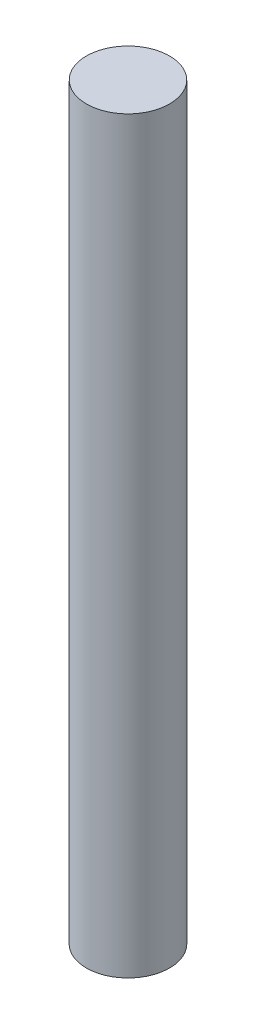
ISO-10303-21;
HEADER;
FILE_DESCRIPTION(('STEP AP214'),'2;1');
FILE_NAME('part.step','',(''),(''),'','','');
FILE_SCHEMA(('AUTOMOTIVE_DESIGN { 1 0 10303 214 1 1 1 1 }'));
ENDSEC;
DATA;
#1=APPLICATION_CONTEXT('core data for automotive mechanical design processes');
#2=APPLICATION_PROTOCOL_DEFINITION('international standard','automotive_design',2000,#1);
#3=PRODUCT_CONTEXT('',#1,'mechanical');
#4=PRODUCT('Part','Part','',(#3));
#5=PRODUCT_RELATED_PRODUCT_CATEGORY('part','',(#4));
#6=PRODUCT_DEFINITION_FORMATION('','',#4);
#7=PRODUCT_DEFINITION_CONTEXT('part definition',#1,'design');
#8=PRODUCT_DEFINITION('design','',#6,#7);
#9=PRODUCT_DEFINITION_SHAPE('','',#8);
#10=(LENGTH_UNIT() NAMED_UNIT(*) SI_UNIT(.MILLI.,.METRE.));
#11=(NAMED_UNIT(*) PLANE_ANGLE_UNIT() SI_UNIT($,.RADIAN.));
#12=(NAMED_UNIT(*) SI_UNIT($,.STERADIAN.) SOLID_ANGLE_UNIT());
#13=UNCERTAINTY_MEASURE_WITH_UNIT(LENGTH_MEASURE(1.E-05),#10,'distance_accuracy_value','');
#14=(GEOMETRIC_REPRESENTATION_CONTEXT(3) GLOBAL_UNCERTAINTY_ASSIGNED_CONTEXT((#13)) GLOBAL_UNIT_ASSIGNED_CONTEXT((#10,
#11,#12)) REPRESENTATION_CONTEXT('',''));
#15=CARTESIAN_POINT('',(0.,0.,0.));
#16=DIRECTION('',(0.,0.,1.));
#17=DIRECTION('',(1.,0.,0.));
#18=AXIS2_PLACEMENT_3D('',#15,#16,#17);
#19=CARTESIAN_POINT('',(0.,18.,0.));
#20=DIRECTION('',(0.,-1.,0.));
#21=DIRECTION('',(0.,0.,-1.));
#22=AXIS2_PLACEMENT_3D('',#19,#20,#21);
#23=CYLINDRICAL_SURFACE('',#22,2.);
#24=CARTESIAN_POINT('',(0.,18.,0.));
#25=DIRECTION('',(0.,1.,0.));
#26=DIRECTION('',(0.,0.,1.));
#27=AXIS2_PLACEMENT_3D('',#24,#25,#26);
#28=CIRCLE('',#27,2.);
#29=CARTESIAN_POINT('',(0.,18.,2.));
#30=VERTEX_POINT('',#29);
#31=EDGE_CURVE('E10',#30,#30,#28,.T.);
#32=ORIENTED_EDGE('',*,*,#31,.F.);
#33=EDGE_LOOP('',(#32));
#34=FACE_BOUND('',#33,.T.);
#35=CARTESIAN_POINT('',(0.,-18.,0.));
#36=DIRECTION('',(0.,1.,0.));
#37=DIRECTION('',(0.,0.,1.));
#38=AXIS2_PLACEMENT_3D('',#35,#36,#37);
#39=CIRCLE('',#38,2.);
#40=CARTESIAN_POINT('',(0.,-18.,2.));
#41=VERTEX_POINT('',#40);
#42=EDGE_CURVE('E34',#41,#41,#39,.T.);
#43=ORIENTED_EDGE('',*,*,#42,.T.);
#44=EDGE_LOOP('',(#43));
#45=FACE_BOUND('',#44,.T.);
#46=ADVANCED_FACE('F31',(#34,#45),#23,.T.);
#47=CARTESIAN_POINT('',(0.,18.,0.));
#48=DIRECTION('',(0.,1.,0.));
#49=DIRECTION('',(0.,0.,1.));
#50=AXIS2_PLACEMENT_3D('',#47,#48,#49);
#51=PLANE('',#50);
#52=ORIENTED_EDGE('',*,*,#31,.T.);
#53=EDGE_LOOP('',(#52));
#54=FACE_BOUND('',#53,.T.);
#55=ADVANCED_FACE('F46',(#54),#51,.T.);
#56=CARTESIAN_POINT('',(0.,-18.,0.));
#57=DIRECTION('',(0.,1.,0.));
#58=DIRECTION('',(0.,0.,1.));
#59=AXIS2_PLACEMENT_3D('',#56,#57,#58);
#60=PLANE('',#59);
#61=ORIENTED_EDGE('',*,*,#42,.F.);
#62=EDGE_LOOP('',(#61));
#63=FACE_BOUND('',#62,.T.);
#64=ADVANCED_FACE('F44',(#63),#60,.F.);
#65=CLOSED_SHELL('',(#46,#55,#64));
#66=MANIFOLD_SOLID_BREP('B2',#65);
#67=ADVANCED_BREP_SHAPE_REPRESENTATION('',(#18,#66),#14);
#68=SHAPE_DEFINITION_REPRESENTATION(#9,#67);
ENDSEC;
END-ISO-10303-21;
